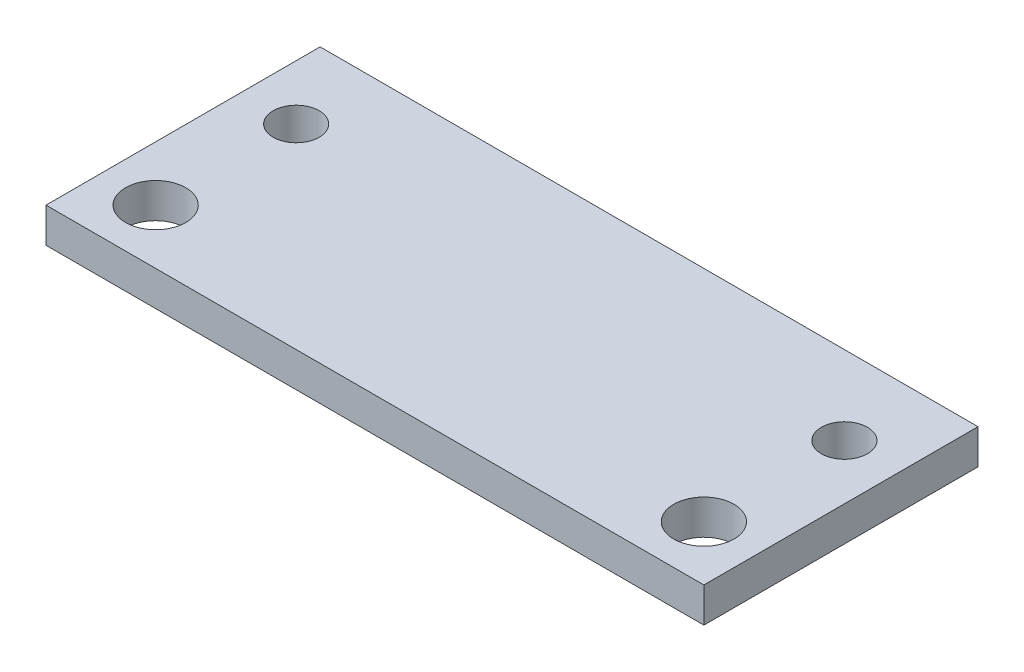
ISO-10303-21;
HEADER;
FILE_DESCRIPTION(('STEP AP214'),'2;1');
FILE_NAME('part.step','',(''),(''),'','','');
FILE_SCHEMA(('AUTOMOTIVE_DESIGN { 1 0 10303 214 1 1 1 1 }'));
ENDSEC;
DATA;
#1=APPLICATION_CONTEXT('core data for automotive mechanical design processes');
#2=APPLICATION_PROTOCOL_DEFINITION('international standard','automotive_design',2000,#1);
#3=PRODUCT_CONTEXT('',#1,'mechanical');
#4=PRODUCT('Part','Part','',(#3));
#5=PRODUCT_RELATED_PRODUCT_CATEGORY('part','',(#4));
#6=PRODUCT_DEFINITION_FORMATION('','',#4);
#7=PRODUCT_DEFINITION_CONTEXT('part definition',#1,'design');
#8=PRODUCT_DEFINITION('design','',#6,#7);
#9=PRODUCT_DEFINITION_SHAPE('','',#8);
#10=(LENGTH_UNIT() NAMED_UNIT(*) SI_UNIT(.MILLI.,.METRE.));
#11=(NAMED_UNIT(*) PLANE_ANGLE_UNIT() SI_UNIT($,.RADIAN.));
#12=(NAMED_UNIT(*) SI_UNIT($,.STERADIAN.) SOLID_ANGLE_UNIT());
#13=UNCERTAINTY_MEASURE_WITH_UNIT(LENGTH_MEASURE(1.E-05),#10,'distance_accuracy_value','');
#14=(GEOMETRIC_REPRESENTATION_CONTEXT(3) GLOBAL_UNCERTAINTY_ASSIGNED_CONTEXT((#13)) GLOBAL_UNIT_ASSIGNED_CONTEXT((#10,
#11,#12)) REPRESENTATION_CONTEXT('',''));
#15=CARTESIAN_POINT('',(0.,0.,0.));
#16=DIRECTION('',(0.,0.,1.));
#17=DIRECTION('',(1.,0.,0.));
#18=AXIS2_PLACEMENT_3D('',#15,#16,#17);
#19=CARTESIAN_POINT('',(0.,3.175,0.));
#20=DIRECTION('',(-1.,0.,0.));
#21=DIRECTION('',(0.,0.,1.));
#22=AXIS2_PLACEMENT_3D('',#19,#20,#21);
#23=PLANE('',#22);
#24=DIRECTION('',(0.,0.,-1.));
#25=VECTOR('',#24,1.);
#26=CARTESIAN_POINT('',(0.,0.,0.));
#27=LINE('',#26,#25);
#28=CARTESIAN_POINT('',(0.,0.,0.));
#29=VERTEX_POINT('',#28);
#30=CARTESIAN_POINT('',(0.,0.,-25.));
#31=VERTEX_POINT('',#30);
#32=EDGE_CURVE('E111',#29,#31,#27,.T.);
#33=ORIENTED_EDGE('',*,*,#32,.T.);
#34=DIRECTION('',(0.,-1.,0.));
#35=VECTOR('',#34,1.);
#36=CARTESIAN_POINT('',(0.,3.175,-25.));
#37=LINE('',#36,#35);
#38=CARTESIAN_POINT('',(0.,3.175,-25.));
#39=VERTEX_POINT('',#38);
#40=EDGE_CURVE('E11',#39,#31,#37,.T.);
#41=ORIENTED_EDGE('',*,*,#40,.F.);
#42=DIRECTION('',(0.,0.,-1.));
#43=VECTOR('',#42,1.);
#44=CARTESIAN_POINT('',(0.,3.175,0.));
#45=LINE('',#44,#43);
#46=CARTESIAN_POINT('',(0.,3.175,0.));
#47=VERTEX_POINT('',#46);
#48=EDGE_CURVE('E94',#47,#39,#45,.T.);
#49=ORIENTED_EDGE('',*,*,#48,.F.);
#50=DIRECTION('',(0.,-1.,0.));
#51=VECTOR('',#50,1.);
#52=CARTESIAN_POINT('',(0.,3.175,0.));
#53=LINE('',#52,#51);
#54=EDGE_CURVE('E107',#47,#29,#53,.T.);
#55=ORIENTED_EDGE('',*,*,#54,.T.);
#56=EDGE_LOOP('',(#33,#41,#49,#55));
#57=FACE_BOUND('',#56,.T.);
#58=ADVANCED_FACE('F41',(#57),#23,.F.);
#59=CARTESIAN_POINT('',(0.,3.175,-25.));
#60=DIRECTION('',(0.,0.,1.));
#61=DIRECTION('',(1.,0.,0.));
#62=AXIS2_PLACEMENT_3D('',#59,#60,#61);
#63=PLANE('',#62);
#64=DIRECTION('',(-1.,0.,0.));
#65=VECTOR('',#64,1.);
#66=CARTESIAN_POINT('',(0.,0.,-25.));
#67=LINE('',#66,#65);
#68=CARTESIAN_POINT('',(-60.,0.,-25.));
#69=VERTEX_POINT('',#68);
#70=EDGE_CURVE('E99',#31,#69,#67,.T.);
#71=ORIENTED_EDGE('',*,*,#70,.T.);
#72=DIRECTION('',(0.,-1.,0.));
#73=VECTOR('',#72,1.);
#74=CARTESIAN_POINT('',(-60.,3.175,-25.));
#75=LINE('',#74,#73);
#76=CARTESIAN_POINT('',(-60.,3.175,-25.));
#77=VERTEX_POINT('',#76);
#78=EDGE_CURVE('E51',#77,#69,#75,.T.);
#79=ORIENTED_EDGE('',*,*,#78,.F.);
#80=DIRECTION('',(-1.,0.,0.));
#81=VECTOR('',#80,1.);
#82=CARTESIAN_POINT('',(0.,3.175,-25.));
#83=LINE('',#82,#81);
#84=EDGE_CURVE('E89',#39,#77,#83,.T.);
#85=ORIENTED_EDGE('',*,*,#84,.F.);
#86=ORIENTED_EDGE('',*,*,#40,.T.);
#87=EDGE_LOOP('',(#71,#79,#85,#86));
#88=FACE_BOUND('',#87,.T.);
#89=ADVANCED_FACE('F98',(#88),#63,.F.);
#90=CARTESIAN_POINT('',(-60.,3.175,0.));
#91=DIRECTION('',(1.,0.,0.));
#92=DIRECTION('',(0.,0.,-1.));
#93=AXIS2_PLACEMENT_3D('',#90,#91,#92);
#94=PLANE('',#93);
#95=DIRECTION('',(0.,0.,1.));
#96=VECTOR('',#95,1.);
#97=CARTESIAN_POINT('',(-60.,0.,0.));
#98=LINE('',#97,#96);
#99=CARTESIAN_POINT('',(-60.,0.,0.));
#100=VERTEX_POINT('',#99);
#101=EDGE_CURVE('E76',#69,#100,#98,.T.);
#102=ORIENTED_EDGE('',*,*,#101,.T.);
#103=DIRECTION('',(0.,-1.,0.));
#104=VECTOR('',#103,1.);
#105=CARTESIAN_POINT('',(-60.,3.175,0.));
#106=LINE('',#105,#104);
#107=CARTESIAN_POINT('',(-60.,3.175,0.));
#108=VERTEX_POINT('',#107);
#109=EDGE_CURVE('E101',#108,#100,#106,.T.);
#110=ORIENTED_EDGE('',*,*,#109,.F.);
#111=DIRECTION('',(0.,0.,1.));
#112=VECTOR('',#111,1.);
#113=CARTESIAN_POINT('',(-60.,3.175,0.));
#114=LINE('',#113,#112);
#115=EDGE_CURVE('E92',#77,#108,#114,.T.);
#116=ORIENTED_EDGE('',*,*,#115,.F.);
#117=ORIENTED_EDGE('',*,*,#78,.T.);
#118=EDGE_LOOP('',(#102,#110,#116,#117));
#119=FACE_BOUND('',#118,.T.);
#120=ADVANCED_FACE('F103',(#119),#94,.F.);
#121=CARTESIAN_POINT('',(0.,3.175,0.));
#122=DIRECTION('',(0.,0.,-1.));
#123=DIRECTION('',(-1.,0.,0.));
#124=AXIS2_PLACEMENT_3D('',#121,#122,#123);
#125=PLANE('',#124);
#126=DIRECTION('',(1.,0.,0.));
#127=VECTOR('',#126,1.);
#128=CARTESIAN_POINT('',(0.,0.,0.));
#129=LINE('',#128,#127);
#130=EDGE_CURVE('E82',#100,#29,#129,.T.);
#131=ORIENTED_EDGE('',*,*,#130,.T.);
#132=ORIENTED_EDGE('',*,*,#54,.F.);
#133=DIRECTION('',(1.,0.,0.));
#134=VECTOR('',#133,1.);
#135=CARTESIAN_POINT('',(0.,3.175,0.));
#136=LINE('',#135,#134);
#137=EDGE_CURVE('E59',#108,#47,#136,.T.);
#138=ORIENTED_EDGE('',*,*,#137,.F.);
#139=ORIENTED_EDGE('',*,*,#109,.T.);
#140=EDGE_LOOP('',(#131,#132,#138,#139));
#141=FACE_BOUND('',#140,.T.);
#142=ADVANCED_FACE('F125',(#141),#125,.F.);
#143=CARTESIAN_POINT('',(0.,3.175,0.));
#144=DIRECTION('',(0.,1.,0.));
#145=DIRECTION('',(0.,0.,1.));
#146=AXIS2_PLACEMENT_3D('',#143,#144,#145);
#147=PLANE('',#146);
#148=CARTESIAN_POINT('',(-55.,3.175,-17.8156));
#149=DIRECTION('',(0.,1.,0.));
#150=DIRECTION('',(0.,0.,1.));
#151=AXIS2_PLACEMENT_3D('',#148,#149,#150);
#152=CIRCLE('',#151,2.1);
#153=CARTESIAN_POINT('',(-55.,3.175,-15.7156));
#154=VERTEX_POINT('',#153);
#155=EDGE_CURVE('E155',#154,#154,#152,.T.);
#156=ORIENTED_EDGE('',*,*,#155,.F.);
#157=EDGE_LOOP('',(#156));
#158=FACE_BOUND('',#157,.T.);
#159=CARTESIAN_POINT('',(-5.,3.175,-17.8156));
#160=DIRECTION('',(0.,1.,0.));
#161=DIRECTION('',(0.,0.,1.));
#162=AXIS2_PLACEMENT_3D('',#159,#160,#161);
#163=CIRCLE('',#162,2.1);
#164=CARTESIAN_POINT('',(-5.,3.175,-15.7156));
#165=VERTEX_POINT('',#164);
#166=EDGE_CURVE('E151',#165,#165,#163,.T.);
#167=ORIENTED_EDGE('',*,*,#166,.F.);
#168=EDGE_LOOP('',(#167));
#169=FACE_BOUND('',#168,.T.);
#170=CARTESIAN_POINT('',(-55.,3.175,-4.99999999999999));
#171=DIRECTION('',(0.,1.,0.));
#172=DIRECTION('',(0.,0.,1.));
#173=AXIS2_PLACEMENT_3D('',#170,#171,#172);
#174=CIRCLE('',#173,2.74999999999999);
#175=CARTESIAN_POINT('',(-55.,3.175,-2.25));
#176=VERTEX_POINT('',#175);
#177=EDGE_CURVE('E143',#176,#176,#174,.T.);
#178=ORIENTED_EDGE('',*,*,#177,.F.);
#179=EDGE_LOOP('',(#178));
#180=FACE_BOUND('',#179,.T.);
#181=CARTESIAN_POINT('',(-5.,3.175,-4.99999999999999));
#182=DIRECTION('',(0.,1.,0.));
#183=DIRECTION('',(0.,0.,1.));
#184=AXIS2_PLACEMENT_3D('',#181,#182,#183);
#185=CIRCLE('',#184,2.74999999999999);
#186=CARTESIAN_POINT('',(-5.,3.175,-2.25));
#187=VERTEX_POINT('',#186);
#188=EDGE_CURVE('E135',#187,#187,#185,.T.);
#189=ORIENTED_EDGE('',*,*,#188,.F.);
#190=EDGE_LOOP('',(#189));
#191=FACE_BOUND('',#190,.T.);
#192=ORIENTED_EDGE('',*,*,#48,.T.);
#193=ORIENTED_EDGE('',*,*,#84,.T.);
#194=ORIENTED_EDGE('',*,*,#115,.T.);
#195=ORIENTED_EDGE('',*,*,#137,.T.);
#196=EDGE_LOOP('',(#192,#193,#194,#195));
#197=FACE_BOUND('',#196,.T.);
#198=ADVANCED_FACE('F90',(#158,#169,#180,#191,#197),#147,.T.);
#199=CARTESIAN_POINT('',(0.,0.,0.));
#200=DIRECTION('',(0.,1.,0.));
#201=DIRECTION('',(0.,0.,1.));
#202=AXIS2_PLACEMENT_3D('',#199,#200,#201);
#203=PLANE('',#202);
#204=CARTESIAN_POINT('',(-55.,0.,-17.8156));
#205=DIRECTION('',(0.,1.,0.));
#206=DIRECTION('',(0.,0.,1.));
#207=AXIS2_PLACEMENT_3D('',#204,#205,#206);
#208=CIRCLE('',#207,2.1);
#209=CARTESIAN_POINT('',(-55.,0.,-15.7156));
#210=VERTEX_POINT('',#209);
#211=EDGE_CURVE('E44',#210,#210,#208,.T.);
#212=ORIENTED_EDGE('',*,*,#211,.T.);
#213=EDGE_LOOP('',(#212));
#214=FACE_BOUND('',#213,.T.);
#215=CARTESIAN_POINT('',(-5.,0.,-17.8156));
#216=DIRECTION('',(0.,1.,0.));
#217=DIRECTION('',(0.,0.,1.));
#218=AXIS2_PLACEMENT_3D('',#215,#216,#217);
#219=CIRCLE('',#218,2.1);
#220=CARTESIAN_POINT('',(-5.,0.,-15.7156));
#221=VERTEX_POINT('',#220);
#222=EDGE_CURVE('E147',#221,#221,#219,.T.);
#223=ORIENTED_EDGE('',*,*,#222,.T.);
#224=EDGE_LOOP('',(#223));
#225=FACE_BOUND('',#224,.T.);
#226=CARTESIAN_POINT('',(-55.,0.,-4.99999999999999));
#227=DIRECTION('',(0.,1.,0.));
#228=DIRECTION('',(0.,0.,1.));
#229=AXIS2_PLACEMENT_3D('',#226,#227,#228);
#230=CIRCLE('',#229,2.74999999999999);
#231=CARTESIAN_POINT('',(-55.,0.,-2.25));
#232=VERTEX_POINT('',#231);
#233=EDGE_CURVE('E139',#232,#232,#230,.T.);
#234=ORIENTED_EDGE('',*,*,#233,.T.);
#235=EDGE_LOOP('',(#234));
#236=FACE_BOUND('',#235,.T.);
#237=CARTESIAN_POINT('',(-5.,0.,-4.99999999999999));
#238=DIRECTION('',(0.,1.,0.));
#239=DIRECTION('',(0.,0.,1.));
#240=AXIS2_PLACEMENT_3D('',#237,#238,#239);
#241=CIRCLE('',#240,2.74999999999999);
#242=CARTESIAN_POINT('',(-5.,0.,-2.25));
#243=VERTEX_POINT('',#242);
#244=EDGE_CURVE('E115',#243,#243,#241,.T.);
#245=ORIENTED_EDGE('',*,*,#244,.T.);
#246=EDGE_LOOP('',(#245));
#247=FACE_BOUND('',#246,.T.);
#248=ORIENTED_EDGE('',*,*,#32,.F.);
#249=ORIENTED_EDGE('',*,*,#130,.F.);
#250=ORIENTED_EDGE('',*,*,#101,.F.);
#251=ORIENTED_EDGE('',*,*,#70,.F.);
#252=EDGE_LOOP('',(#248,#249,#250,#251));
#253=FACE_BOUND('',#252,.T.);
#254=ADVANCED_FACE('F128',(#214,#225,#236,#247,#253),#203,.F.);
#255=CARTESIAN_POINT('',(-5.,3.175,-4.99999999999999));
#256=DIRECTION('',(0.,1.,0.));
#257=DIRECTION('',(0.,0.,1.));
#258=AXIS2_PLACEMENT_3D('',#255,#256,#257);
#259=CYLINDRICAL_SURFACE('',#258,2.74999999999999);
#260=ORIENTED_EDGE('',*,*,#188,.T.);
#261=EDGE_LOOP('',(#260));
#262=FACE_BOUND('',#261,.T.);
#263=ORIENTED_EDGE('',*,*,#244,.F.);
#264=EDGE_LOOP('',(#263));
#265=FACE_BOUND('',#264,.T.);
#266=ADVANCED_FACE('F189',(#262,#265),#259,.F.);
#267=CARTESIAN_POINT('',(-55.,3.175,-4.99999999999999));
#268=DIRECTION('',(0.,1.,0.));
#269=DIRECTION('',(0.,0.,1.));
#270=AXIS2_PLACEMENT_3D('',#267,#268,#269);
#271=CYLINDRICAL_SURFACE('',#270,2.74999999999999);
#272=ORIENTED_EDGE('',*,*,#177,.T.);
#273=EDGE_LOOP('',(#272));
#274=FACE_BOUND('',#273,.T.);
#275=ORIENTED_EDGE('',*,*,#233,.F.);
#276=EDGE_LOOP('',(#275));
#277=FACE_BOUND('',#276,.T.);
#278=ADVANCED_FACE('F173',(#274,#277),#271,.F.);
#279=CARTESIAN_POINT('',(-5.,3.175,-17.8156));
#280=DIRECTION('',(0.,1.,0.));
#281=DIRECTION('',(0.,0.,1.));
#282=AXIS2_PLACEMENT_3D('',#279,#280,#281);
#283=CYLINDRICAL_SURFACE('',#282,2.1);
#284=ORIENTED_EDGE('',*,*,#166,.T.);
#285=EDGE_LOOP('',(#284));
#286=FACE_BOUND('',#285,.T.);
#287=ORIENTED_EDGE('',*,*,#222,.F.);
#288=EDGE_LOOP('',(#287));
#289=FACE_BOUND('',#288,.T.);
#290=ADVANCED_FACE('F168',(#286,#289),#283,.F.);
#291=CARTESIAN_POINT('',(-55.,3.175,-17.8156));
#292=DIRECTION('',(0.,1.,0.));
#293=DIRECTION('',(0.,0.,1.));
#294=AXIS2_PLACEMENT_3D('',#291,#292,#293);
#295=CYLINDRICAL_SURFACE('',#294,2.1);
#296=ORIENTED_EDGE('',*,*,#155,.T.);
#297=EDGE_LOOP('',(#296));
#298=FACE_BOUND('',#297,.T.);
#299=ORIENTED_EDGE('',*,*,#211,.F.);
#300=EDGE_LOOP('',(#299));
#301=FACE_BOUND('',#300,.T.);
#302=ADVANCED_FACE('F166',(#298,#301),#295,.F.);
#303=CLOSED_SHELL('',(#58,#89,#120,#142,#198,#254,#266,#278,#290,#302));
#304=MANIFOLD_SOLID_BREP('B2',#303);
#305=ADVANCED_BREP_SHAPE_REPRESENTATION('',(#18,#304),#14);
#306=SHAPE_DEFINITION_REPRESENTATION(#9,#305);
ENDSEC;
END-ISO-10303-21;
